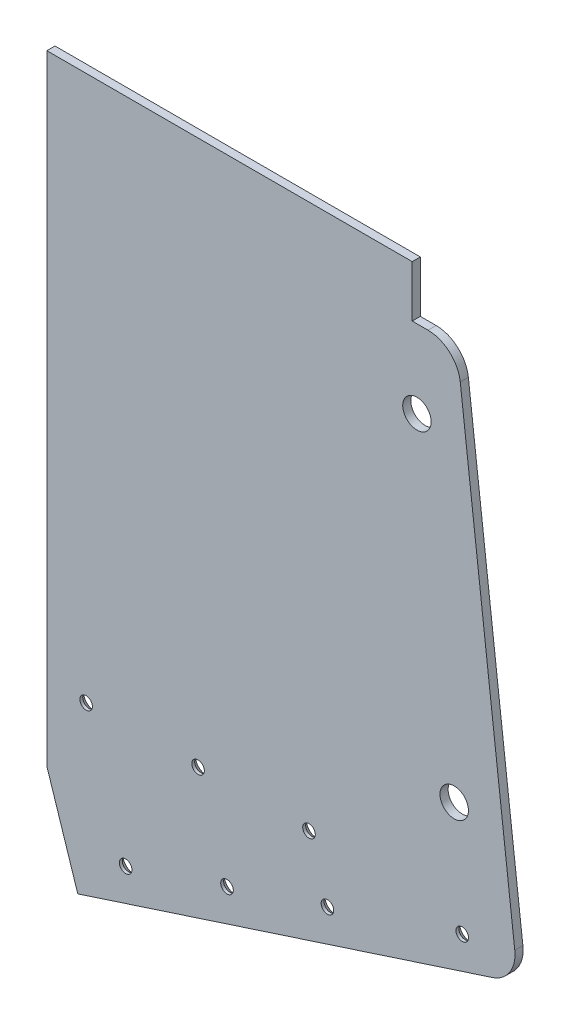
ISO-10303-21;
HEADER;
FILE_DESCRIPTION(('STEP AP214'),'2;1');
FILE_NAME('part.step','',(''),(''),'','','');
FILE_SCHEMA(('AUTOMOTIVE_DESIGN { 1 0 10303 214 1 1 1 1 }'));
ENDSEC;
DATA;
#1=APPLICATION_CONTEXT('core data for automotive mechanical design processes');
#2=APPLICATION_PROTOCOL_DEFINITION('international standard','automotive_design',2000,#1);
#3=PRODUCT_CONTEXT('',#1,'mechanical');
#4=PRODUCT('Part','Part','',(#3));
#5=PRODUCT_RELATED_PRODUCT_CATEGORY('part','',(#4));
#6=PRODUCT_DEFINITION_FORMATION('','',#4);
#7=PRODUCT_DEFINITION_CONTEXT('part definition',#1,'design');
#8=PRODUCT_DEFINITION('design','',#6,#7);
#9=PRODUCT_DEFINITION_SHAPE('','',#8);
#10=(LENGTH_UNIT() NAMED_UNIT(*) SI_UNIT(.MILLI.,.METRE.));
#11=(NAMED_UNIT(*) PLANE_ANGLE_UNIT() SI_UNIT($,.RADIAN.));
#12=(NAMED_UNIT(*) SI_UNIT($,.STERADIAN.) SOLID_ANGLE_UNIT());
#13=UNCERTAINTY_MEASURE_WITH_UNIT(LENGTH_MEASURE(1.E-05),#10,'distance_accuracy_value','');
#14=(GEOMETRIC_REPRESENTATION_CONTEXT(3) GLOBAL_UNCERTAINTY_ASSIGNED_CONTEXT((#13)) GLOBAL_UNIT_ASSIGNED_CONTEXT((#10,
#11,#12)) REPRESENTATION_CONTEXT('',''));
#15=CARTESIAN_POINT('',(0.,0.,0.));
#16=DIRECTION('',(0.,0.,1.));
#17=DIRECTION('',(1.,0.,0.));
#18=AXIS2_PLACEMENT_3D('',#15,#16,#17);
#19=CARTESIAN_POINT('',(-234.75296718065,12.6999999999999,3.17499999999984));
#20=DIRECTION('',(1.,0.,0.));
#21=DIRECTION('',(0.,1.,0.));
#22=AXIS2_PLACEMENT_3D('',#19,#20,#21);
#23=PLANE('',#22);
#24=DIRECTION('',(0.,-1.,0.));
#25=VECTOR('',#24,1.);
#26=CARTESIAN_POINT('',(-234.75296718065,12.6999999999999,-7.49400541621981E-13));
#27=LINE('',#26,#25);
#28=CARTESIAN_POINT('',(-234.75296718065,12.6999999999999,-7.49400541621981E-13));
#29=VERTEX_POINT('',#28);
#30=CARTESIAN_POINT('',(-234.75296718065,-229.485553097581,0.));
#31=VERTEX_POINT('',#30);
#32=EDGE_CURVE('E131',#29,#31,#27,.T.);
#33=ORIENTED_EDGE('',*,*,#32,.T.);
#34=DIRECTION('',(0.,0.,1.));
#35=VECTOR('',#34,1.);
#36=CARTESIAN_POINT('',(-234.75296718065,-229.485553097581,0.));
#37=LINE('',#36,#35);
#38=CARTESIAN_POINT('',(-234.75296718065,-229.485553097581,3.17499999999998));
#39=VERTEX_POINT('',#38);
#40=EDGE_CURVE('E58',#31,#39,#37,.T.);
#41=ORIENTED_EDGE('',*,*,#40,.T.);
#42=DIRECTION('',(0.,-1.,0.));
#43=VECTOR('',#42,1.);
#44=CARTESIAN_POINT('',(-234.75296718065,12.6999999999999,3.17499999999984));
#45=LINE('',#44,#43);
#46=CARTESIAN_POINT('',(-234.75296718065,12.6999999999999,3.17499999999984));
#47=VERTEX_POINT('',#46);
#48=EDGE_CURVE('E144',#47,#39,#45,.T.);
#49=ORIENTED_EDGE('',*,*,#48,.F.);
#50=DIRECTION('',(0.,0.,-1.));
#51=VECTOR('',#50,1.);
#52=CARTESIAN_POINT('',(-234.75296718065,12.6999999999999,3.17499999999984));
#53=LINE('',#52,#51);
#54=EDGE_CURVE('E145',#47,#29,#53,.T.);
#55=ORIENTED_EDGE('',*,*,#54,.T.);
#56=EDGE_LOOP('',(#33,#41,#49,#55));
#57=FACE_BOUND('',#56,.T.);
#58=ADVANCED_FACE('F43',(#57),#23,.F.);
#59=CARTESIAN_POINT('',(-234.752967180649,-270.542758327658,3.17500000000004));
#60=DIRECTION('',(-0.309324512684967,0.950956542567645,0.));
#61=DIRECTION('',(-0.950956542567645,-0.309324512684967,0.));
#62=AXIS2_PLACEMENT_3D('',#59,#60,#61);
#63=PLANE('',#62);
#64=DIRECTION('',(0.950956542567645,0.309324512684967,0.));
#65=VECTOR('',#64,1.);
#66=CARTESIAN_POINT('',(-234.752967180649,-270.542758327658,3.17500000000004));
#67=LINE('',#66,#65);
#68=CARTESIAN_POINT('',(-222.675819090041,-266.614337016557,3.17499999999998));
#69=VERTEX_POINT('',#68);
#70=CARTESIAN_POINT('',(-60.5974720840375,-213.893940804709,3.17500000000032));
#71=VERTEX_POINT('',#70);
#72=EDGE_CURVE('E66',#69,#71,#67,.T.);
#73=ORIENTED_EDGE('',*,*,#72,.F.);
#74=DIRECTION('',(0.,0.,1.));
#75=VECTOR('',#74,1.);
#76=CARTESIAN_POINT('',(-222.675819090041,-266.614337016557,0.));
#77=LINE('',#76,#75);
#78=CARTESIAN_POINT('',(-222.675819090041,-266.614337016557,0.));
#79=VERTEX_POINT('',#78);
#80=EDGE_CURVE('E114',#79,#69,#77,.T.);
#81=ORIENTED_EDGE('',*,*,#80,.F.);
#82=DIRECTION('',(0.950956542567645,0.309324512684967,0.));
#83=VECTOR('',#82,1.);
#84=CARTESIAN_POINT('',(-234.752967180649,-270.542758327658,0.));
#85=LINE('',#84,#83);
#86=CARTESIAN_POINT('',(-60.5974720840375,-213.893940804709,3.33066907387547E-13));
#87=VERTEX_POINT('',#86);
#88=EDGE_CURVE('E123',#79,#87,#85,.T.);
#89=ORIENTED_EDGE('',*,*,#88,.T.);
#90=DIRECTION('',(0.,0.,-1.));
#91=VECTOR('',#90,1.);
#92=CARTESIAN_POINT('',(-60.5974720840375,-213.893940804709,3.17500000000032));
#93=LINE('',#92,#91);
#94=EDGE_CURVE('E11',#87,#71,#93,.F.);
#95=ORIENTED_EDGE('',*,*,#94,.T.);
#96=EDGE_LOOP('',(#73,#81,#89,#95));
#97=FACE_BOUND('',#96,.T.);
#98=ADVANCED_FACE('F122',(#97),#63,.F.);
#99=CARTESIAN_POINT('',(-74.5334651306724,-7.41697903189409,3.17499999999998));
#100=DIRECTION('',(-0.993195579602869,-0.11645832154604,0.));
#101=DIRECTION('',(0.11645832154604,-0.993195579602869,0.));
#102=AXIS2_PLACEMENT_3D('',#99,#100,#101);
#103=PLANE('',#102);
#104=DIRECTION('',(-0.11645832154604,0.993195579602869,0.));
#105=VECTOR('',#104,1.);
#106=CARTESIAN_POINT('',(-74.5334651306729,-7.41697903189298,0.));
#107=LINE('',#106,#105);
#108=CARTESIAN_POINT('',(-51.9123095341807,-200.337772030466,0.));
#109=VERTEX_POINT('',#108);
#110=CARTESIAN_POINT('',(-73.217735938836,-18.6379583482581,7.49400541621981E-13));
#111=VERTEX_POINT('',#110);
#112=EDGE_CURVE('E130',#109,#111,#107,.T.);
#113=ORIENTED_EDGE('',*,*,#112,.T.);
#114=DIRECTION('',(0.,0.,-1.));
#115=VECTOR('',#114,1.);
#116=CARTESIAN_POINT('',(-73.217735938836,-18.637958348259,3.17500000000073));
#117=LINE('',#116,#115);
#118=CARTESIAN_POINT('',(-73.217735938836,-18.637958348259,3.17500000000073));
#119=VERTEX_POINT('',#118);
#120=EDGE_CURVE('E164',#111,#119,#117,.F.);
#121=ORIENTED_EDGE('',*,*,#120,.T.);
#122=DIRECTION('',(-0.11645832154604,0.993195579602869,0.));
#123=VECTOR('',#122,1.);
#124=CARTESIAN_POINT('',(-74.5334651306724,-7.41697903189409,3.17499999999998));
#125=LINE('',#124,#123);
#126=CARTESIAN_POINT('',(-51.9123095341809,-200.337772030466,3.17499999999998));
#127=VERTEX_POINT('',#126);
#128=EDGE_CURVE('E175',#127,#119,#125,.T.);
#129=ORIENTED_EDGE('',*,*,#128,.F.);
#130=DIRECTION('',(0.,0.,-1.));
#131=VECTOR('',#130,1.);
#132=CARTESIAN_POINT('',(-51.9123095341809,-200.337772030466,3.17499999999998));
#133=LINE('',#132,#131);
#134=EDGE_CURVE('E161',#127,#109,#133,.T.);
#135=ORIENTED_EDGE('',*,*,#134,.T.);
#136=EDGE_LOOP('',(#113,#121,#129,#135));
#137=FACE_BOUND('',#136,.T.);
#138=ADVANCED_FACE('F188',(#137),#103,.F.);
#139=CARTESIAN_POINT('',(-74.5334651306724,-7.41697903189409,3.17499999999998));
#140=DIRECTION('',(0.,-1.,0.));
#141=DIRECTION('',(1.,0.,0.));
#142=AXIS2_PLACEMENT_3D('',#139,#140,#141);
#143=PLANE('',#142);
#144=DIRECTION('',(-1.,0.,0.));
#145=VECTOR('',#144,1.);
#146=CARTESIAN_POINT('',(-74.5334651306724,-7.41697903189409,3.17499999999998));
#147=LINE('',#146,#145);
#148=CARTESIAN_POINT('',(-85.831319799792,-7.41697903189453,3.17500000000004));
#149=VERTEX_POINT('',#148);
#150=CARTESIAN_POINT('',(-91.997327392618,-7.41697903189364,3.17500000000004));
#151=VERTEX_POINT('',#150);
#152=EDGE_CURVE('E172',#149,#151,#147,.T.);
#153=ORIENTED_EDGE('',*,*,#152,.F.);
#154=DIRECTION('',(0.,0.,-1.));
#155=VECTOR('',#154,1.);
#156=CARTESIAN_POINT('',(-85.831319799792,-7.41697903189453,3.17500000000004));
#157=LINE('',#156,#155);
#158=CARTESIAN_POINT('',(-85.8313197997921,-7.41697903189387,0.));
#159=VERTEX_POINT('',#158);
#160=EDGE_CURVE('E155',#149,#159,#157,.T.);
#161=ORIENTED_EDGE('',*,*,#160,.T.);
#162=DIRECTION('',(-1.,0.,0.));
#163=VECTOR('',#162,1.);
#164=CARTESIAN_POINT('',(-74.5334651306729,-7.41697903189298,0.));
#165=LINE('',#164,#163);
#166=CARTESIAN_POINT('',(-91.997327392618,-7.41697903189364,0.));
#167=VERTEX_POINT('',#166);
#168=EDGE_CURVE('E134',#159,#167,#165,.T.);
#169=ORIENTED_EDGE('',*,*,#168,.T.);
#170=DIRECTION('',(0.,0.,-1.));
#171=VECTOR('',#170,1.);
#172=CARTESIAN_POINT('',(-91.997327392618,-7.41697903189364,3.17500000000004));
#173=LINE('',#172,#171);
#174=EDGE_CURVE('E152',#151,#167,#173,.T.);
#175=ORIENTED_EDGE('',*,*,#174,.F.);
#176=EDGE_LOOP('',(#153,#161,#169,#175));
#177=FACE_BOUND('',#176,.T.);
#178=ADVANCED_FACE('F180',(#177),#143,.F.);
#179=CARTESIAN_POINT('',(-91.997327392618,-7.41697903189364,3.17500000000004));
#180=DIRECTION('',(-1.,0.,0.));
#181=DIRECTION('',(0.,0.,1.));
#182=AXIS2_PLACEMENT_3D('',#179,#180,#181);
#183=PLANE('',#182);
#184=DIRECTION('',(0.,1.,0.));
#185=VECTOR('',#184,1.);
#186=CARTESIAN_POINT('',(-91.997327392618,-7.41697903189364,0.));
#187=LINE('',#186,#185);
#188=CARTESIAN_POINT('',(-91.9973273926186,12.6999999999995,0.));
#189=VERTEX_POINT('',#188);
#190=EDGE_CURVE('E140',#167,#189,#187,.T.);
#191=ORIENTED_EDGE('',*,*,#190,.T.);
#192=DIRECTION('',(0.,0.,-1.));
#193=VECTOR('',#192,1.);
#194=CARTESIAN_POINT('',(-91.9973273926186,12.6999999999984,3.17499999999998));
#195=LINE('',#194,#193);
#196=CARTESIAN_POINT('',(-91.9973273926186,12.6999999999984,3.17499999999998));
#197=VERTEX_POINT('',#196);
#198=EDGE_CURVE('E148',#197,#189,#195,.T.);
#199=ORIENTED_EDGE('',*,*,#198,.F.);
#200=DIRECTION('',(0.,1.,0.));
#201=VECTOR('',#200,1.);
#202=CARTESIAN_POINT('',(-91.997327392618,-7.41697903189364,3.17500000000004));
#203=LINE('',#202,#201);
#204=EDGE_CURVE('E183',#151,#197,#203,.T.);
#205=ORIENTED_EDGE('',*,*,#204,.F.);
#206=ORIENTED_EDGE('',*,*,#174,.T.);
#207=EDGE_LOOP('',(#191,#199,#205,#206));
#208=FACE_BOUND('',#207,.T.);
#209=ADVANCED_FACE('F211',(#208),#183,.F.);
#210=CARTESIAN_POINT('',(-234.75296718065,12.6999999999999,3.17499999999984));
#211=DIRECTION('',(0.,-1.,0.));
#212=DIRECTION('',(1.,0.,0.));
#213=AXIS2_PLACEMENT_3D('',#210,#211,#212);
#214=PLANE('',#213);
#215=DIRECTION('',(-1.,0.,0.));
#216=VECTOR('',#215,1.);
#217=CARTESIAN_POINT('',(-234.75296718065,12.6999999999999,-7.49400541621981E-13));
#218=LINE('',#217,#216);
#219=EDGE_CURVE('E142',#189,#29,#218,.T.);
#220=ORIENTED_EDGE('',*,*,#219,.T.);
#221=ORIENTED_EDGE('',*,*,#54,.F.);
#222=DIRECTION('',(-1.,0.,0.));
#223=VECTOR('',#222,1.);
#224=CARTESIAN_POINT('',(-234.75296718065,12.6999999999999,3.17499999999984));
#225=LINE('',#224,#223);
#226=EDGE_CURVE('E149',#197,#47,#225,.T.);
#227=ORIENTED_EDGE('',*,*,#226,.F.);
#228=ORIENTED_EDGE('',*,*,#198,.T.);
#229=EDGE_LOOP('',(#220,#221,#227,#228));
#230=FACE_BOUND('',#229,.T.);
#231=ADVANCED_FACE('F214',(#230),#214,.F.);
#232=CARTESIAN_POINT('',(0.,0.,3.17499999999998));
#233=DIRECTION('',(0.,0.,-1.));
#234=DIRECTION('',(-1.,0.,0.));
#235=AXIS2_PLACEMENT_3D('',#232,#233,#234);
#236=PLANE('',#235);
#237=CARTESIAN_POINT('',(-90.146601991197,-37.8407515828578,3.17500000000073));
#238=DIRECTION('',(0.,0.,1.));
#239=DIRECTION('',(1.,0.,0.));
#240=AXIS2_PLACEMENT_3D('',#237,#238,#239);
#241=CIRCLE('',#240,5.55625);
#242=CARTESIAN_POINT('',(-84.590351991197,-37.8407515828578,3.17500000000073));
#243=VERTEX_POINT('',#242);
#244=EDGE_CURVE('E295',#243,#243,#241,.T.);
#245=ORIENTED_EDGE('',*,*,#244,.F.);
#246=EDGE_LOOP('',(#245));
#247=FACE_BOUND('',#246,.T.);
#248=CARTESIAN_POINT('',(-75.5766743950044,-162.097975038986,3.17500000000062));
#249=DIRECTION('',(0.,0.,1.));
#250=DIRECTION('',(1.,0.,0.));
#251=AXIS2_PLACEMENT_3D('',#248,#249,#250);
#252=CIRCLE('',#251,5.55625);
#253=CARTESIAN_POINT('',(-70.0204243950044,-162.097975038986,3.17500000000062));
#254=VERTEX_POINT('',#253);
#255=EDGE_CURVE('E301',#254,#254,#252,.T.);
#256=ORIENTED_EDGE('',*,*,#255,.F.);
#257=EDGE_LOOP('',(#256));
#258=FACE_BOUND('',#257,.T.);
#259=CARTESIAN_POINT('',(-203.969823430369,-247.917009556366,3.17499999999923));
#260=DIRECTION('',(0.,0.,-1.));
#261=DIRECTION('',(-1.,0.,0.));
#262=AXIS2_PLACEMENT_3D('',#259,#260,#261);
#263=CIRCLE('',#262,2.45744999999994);
#264=CARTESIAN_POINT('',(-206.427273430369,-247.917009556366,3.17499999999923));
#265=VERTEX_POINT('',#264);
#266=EDGE_CURVE('E311',#265,#265,#263,.T.);
#267=ORIENTED_EDGE('',*,*,#266,.T.);
#268=EDGE_LOOP('',(#267));
#269=FACE_BOUND('',#268,.T.);
#270=CARTESIAN_POINT('',(-164.368820636905,-235.035704951384,3.1750000000004));
#271=DIRECTION('',(0.,0.,-1.));
#272=DIRECTION('',(-1.,0.,0.));
#273=AXIS2_PLACEMENT_3D('',#270,#271,#272);
#274=CIRCLE('',#273,2.45744999999994);
#275=CARTESIAN_POINT('',(-166.826270636905,-235.035704951384,3.1750000000004));
#276=VERTEX_POINT('',#275);
#277=EDGE_CURVE('E320',#276,#276,#274,.T.);
#278=ORIENTED_EDGE('',*,*,#277,.T.);
#279=EDGE_LOOP('',(#278));
#280=FACE_BOUND('',#279,.T.);
#281=CARTESIAN_POINT('',(-175.687012216855,-200.240181507182,3.17499999999935));
#282=DIRECTION('',(0.,0.,-1.));
#283=DIRECTION('',(-1.,0.,0.));
#284=AXIS2_PLACEMENT_3D('',#281,#282,#283);
#285=CIRCLE('',#284,2.45744999999994);
#286=CARTESIAN_POINT('',(-178.144462216855,-200.240181507182,3.17499999999935));
#287=VERTEX_POINT('',#286);
#288=EDGE_CURVE('E329',#287,#287,#285,.T.);
#289=ORIENTED_EDGE('',*,*,#288,.T.);
#290=EDGE_LOOP('',(#289));
#291=FACE_BOUND('',#290,.T.);
#292=CARTESIAN_POINT('',(-219.438787807227,-200.360762709867,3.17499999999998));
#293=DIRECTION('',(0.,0.,-1.));
#294=DIRECTION('',(-1.,0.,0.));
#295=AXIS2_PLACEMENT_3D('',#292,#293,#294);
#296=CIRCLE('',#295,2.45744999999994);
#297=CARTESIAN_POINT('',(-221.896237807227,-200.360762709867,3.17499999999998));
#298=VERTEX_POINT('',#297);
#299=EDGE_CURVE('E338',#298,#298,#296,.T.);
#300=ORIENTED_EDGE('',*,*,#299,.T.);
#301=EDGE_LOOP('',(#300));
#302=FACE_BOUND('',#301,.T.);
#303=CARTESIAN_POINT('',(-125.11808934242,-222.2683356903,3.17499999999998));
#304=DIRECTION('',(0.,0.,-1.));
#305=DIRECTION('',(-1.,0.,0.));
#306=AXIS2_PLACEMENT_3D('',#303,#304,#305);
#307=CIRCLE('',#306,2.45744999999994);
#308=CARTESIAN_POINT('',(-127.57553934242,-222.2683356903,3.17499999999998));
#309=VERTEX_POINT('',#308);
#310=EDGE_CURVE('E347',#309,#309,#307,.T.);
#311=ORIENTED_EDGE('',*,*,#310,.T.);
#312=EDGE_LOOP('',(#311));
#313=FACE_BOUND('',#312,.T.);
#314=CARTESIAN_POINT('',(-132.322221776819,-200.12066684715,3.17500000000062));
#315=DIRECTION('',(0.,0.,-1.));
#316=DIRECTION('',(-1.,0.,0.));
#317=AXIS2_PLACEMENT_3D('',#314,#315,#316);
#318=CIRCLE('',#317,2.45744999999994);
#319=CARTESIAN_POINT('',(-134.779671776819,-200.12066684715,3.17500000000062));
#320=VERTEX_POINT('',#319);
#321=EDGE_CURVE('E356',#320,#320,#318,.T.);
#322=ORIENTED_EDGE('',*,*,#321,.T.);
#323=EDGE_LOOP('',(#322));
#324=FACE_BOUND('',#323,.T.);
#325=CARTESIAN_POINT('',(-72.4520660392001,-205.137277367342,3.17499999999998));
#326=DIRECTION('',(0.,0.,-1.));
#327=DIRECTION('',(-1.,0.,0.));
#328=AXIS2_PLACEMENT_3D('',#325,#326,#327);
#329=CIRCLE('',#328,2.45744999999994);
#330=CARTESIAN_POINT('',(-74.9095160392001,-205.137277367342,3.17499999999998));
#331=VERTEX_POINT('',#330);
#332=EDGE_CURVE('E365',#331,#331,#329,.T.);
#333=ORIENTED_EDGE('',*,*,#332,.T.);
#334=EDGE_LOOP('',(#333));
#335=FACE_BOUND('',#334,.T.);
#336=ORIENTED_EDGE('',*,*,#48,.T.);
#337=DIRECTION('',(-0.309324512684967,0.950956542567644,0.));
#338=VECTOR('',#337,1.);
#339=CARTESIAN_POINT('',(-222.675819090041,-266.614337016557,3.17499999999998));
#340=LINE('',#339,#338);
#341=EDGE_CURVE('E119',#69,#39,#340,.T.);
#342=ORIENTED_EDGE('',*,*,#341,.F.);
#343=ORIENTED_EDGE('',*,*,#72,.T.);
#344=CARTESIAN_POINT('',(-64.5258933951371,-201.816792714099,3.17500000000032));
#345=DIRECTION('',(0.,0.,-1.));
#346=DIRECTION('',(-1.,0.,0.));
#347=AXIS2_PLACEMENT_3D('',#344,#345,#346);
#348=CIRCLE('',#347,12.7);
#349=EDGE_CURVE('E166',#71,#127,#348,.F.);
#350=ORIENTED_EDGE('',*,*,#349,.T.);
#351=ORIENTED_EDGE('',*,*,#128,.T.);
#352=CARTESIAN_POINT('',(-85.8313197997925,-20.1169790318931,3.17500000000004));
#353=DIRECTION('',(0.,0.,-1.));
#354=DIRECTION('',(-1.,0.,0.));
#355=AXIS2_PLACEMENT_3D('',#352,#353,#354);
#356=CIRCLE('',#355,12.7);
#357=EDGE_CURVE('E51',#119,#149,#356,.F.);
#358=ORIENTED_EDGE('',*,*,#357,.T.);
#359=ORIENTED_EDGE('',*,*,#152,.T.);
#360=ORIENTED_EDGE('',*,*,#204,.T.);
#361=ORIENTED_EDGE('',*,*,#226,.T.);
#362=EDGE_LOOP('',(#336,#342,#343,#350,#351,#358,#359,#360,#361));
#363=FACE_BOUND('',#362,.T.);
#364=ADVANCED_FACE('F171',(#247,#258,#269,#280,#291,#302,#313,#324,#335,#363),#236,.F.);
#365=CARTESIAN_POINT('',(0.,0.,0.));
#366=DIRECTION('',(0.,0.,-1.));
#367=DIRECTION('',(-1.,0.,0.));
#368=AXIS2_PLACEMENT_3D('',#365,#366,#367);
#369=PLANE('',#368);
#370=CARTESIAN_POINT('',(-90.1466019911962,-37.840751582858,7.49400541621981E-13));
#371=DIRECTION('',(0.,0.,-1.));
#372=DIRECTION('',(-1.,0.,0.));
#373=AXIS2_PLACEMENT_3D('',#370,#371,#372);
#374=CIRCLE('',#373,5.55625);
#375=CARTESIAN_POINT('',(-95.7028519911962,-37.840751582858,7.49400541621981E-13));
#376=VERTEX_POINT('',#375);
#377=EDGE_CURVE('E292',#376,#376,#374,.F.);
#378=ORIENTED_EDGE('',*,*,#377,.T.);
#379=EDGE_LOOP('',(#378));
#380=FACE_BOUND('',#379,.T.);
#381=CARTESIAN_POINT('',(-75.5766743950044,-162.097975038986,6.38378239159465E-13));
#382=DIRECTION('',(0.,0.,-1.));
#383=DIRECTION('',(-1.,0.,0.));
#384=AXIS2_PLACEMENT_3D('',#381,#382,#383);
#385=CIRCLE('',#384,5.55625);
#386=CARTESIAN_POINT('',(-81.1329243950044,-162.097975038986,6.38378239159465E-13));
#387=VERTEX_POINT('',#386);
#388=EDGE_CURVE('E306',#387,#387,#385,.F.);
#389=ORIENTED_EDGE('',*,*,#388,.T.);
#390=EDGE_LOOP('',(#389));
#391=FACE_BOUND('',#390,.T.);
#392=CARTESIAN_POINT('',(-203.969823430369,-247.917009556366,-7.49400541621981E-13));
#393=DIRECTION('',(0.,0.,-1.));
#394=DIRECTION('',(-1.,0.,0.));
#395=AXIS2_PLACEMENT_3D('',#392,#393,#394);
#396=CIRCLE('',#395,4.21640000000001);
#397=CARTESIAN_POINT('',(-208.186223430369,-247.917009556366,-7.49400541621981E-13));
#398=VERTEX_POINT('',#397);
#399=EDGE_CURVE('E296',#398,#398,#396,.T.);
#400=ORIENTED_EDGE('',*,*,#399,.F.);
#401=EDGE_LOOP('',(#400));
#402=FACE_BOUND('',#401,.T.);
#403=CARTESIAN_POINT('',(-164.368820636905,-235.035704951384,4.16333634234434E-13));
#404=DIRECTION('',(0.,0.,-1.));
#405=DIRECTION('',(-1.,0.,0.));
#406=AXIS2_PLACEMENT_3D('',#403,#404,#405);
#407=CIRCLE('',#406,4.21640000000001);
#408=CARTESIAN_POINT('',(-168.585220636905,-235.035704951384,4.16333634234434E-13));
#409=VERTEX_POINT('',#408);
#410=EDGE_CURVE('E314',#409,#409,#407,.T.);
#411=ORIENTED_EDGE('',*,*,#410,.F.);
#412=EDGE_LOOP('',(#411));
#413=FACE_BOUND('',#412,.T.);
#414=CARTESIAN_POINT('',(-175.687012216855,-200.240181507182,-6.38378239159465E-13));
#415=DIRECTION('',(0.,0.,-1.));
#416=DIRECTION('',(-1.,0.,0.));
#417=AXIS2_PLACEMENT_3D('',#414,#415,#416);
#418=CIRCLE('',#417,4.21640000000001);
#419=CARTESIAN_POINT('',(-179.903412216855,-200.240181507182,-6.38378239159465E-13));
#420=VERTEX_POINT('',#419);
#421=EDGE_CURVE('E323',#420,#420,#418,.T.);
#422=ORIENTED_EDGE('',*,*,#421,.F.);
#423=EDGE_LOOP('',(#422));
#424=FACE_BOUND('',#423,.T.);
#425=CARTESIAN_POINT('',(-219.438787807228,-200.360762709867,0.));
#426=DIRECTION('',(0.,0.,-1.));
#427=DIRECTION('',(-1.,0.,0.));
#428=AXIS2_PLACEMENT_3D('',#425,#426,#427);
#429=CIRCLE('',#428,4.21640000000001);
#430=CARTESIAN_POINT('',(-223.655187807228,-200.360762709867,0.));
#431=VERTEX_POINT('',#430);
#432=EDGE_CURVE('E332',#431,#431,#429,.T.);
#433=ORIENTED_EDGE('',*,*,#432,.F.);
#434=EDGE_LOOP('',(#433));
#435=FACE_BOUND('',#434,.T.);
#436=CARTESIAN_POINT('',(-125.11808934242,-222.2683356903,0.));
#437=DIRECTION('',(0.,0.,-1.));
#438=DIRECTION('',(-1.,0.,0.));
#439=AXIS2_PLACEMENT_3D('',#436,#437,#438);
#440=CIRCLE('',#439,4.21639999999999);
#441=CARTESIAN_POINT('',(-129.33448934242,-222.2683356903,0.));
#442=VERTEX_POINT('',#441);
#443=EDGE_CURVE('E341',#442,#442,#440,.T.);
#444=ORIENTED_EDGE('',*,*,#443,.F.);
#445=EDGE_LOOP('',(#444));
#446=FACE_BOUND('',#445,.T.);
#447=CARTESIAN_POINT('',(-132.322221776819,-200.12066684715,5.82867087928207E-13));
#448=DIRECTION('',(0.,0.,-1.));
#449=DIRECTION('',(-1.,0.,0.));
#450=AXIS2_PLACEMENT_3D('',#447,#448,#449);
#451=CIRCLE('',#450,4.21640000000001);
#452=CARTESIAN_POINT('',(-136.538621776819,-200.12066684715,5.82867087928207E-13));
#453=VERTEX_POINT('',#452);
#454=EDGE_CURVE('E350',#453,#453,#451,.T.);
#455=ORIENTED_EDGE('',*,*,#454,.F.);
#456=EDGE_LOOP('',(#455));
#457=FACE_BOUND('',#456,.T.);
#458=CARTESIAN_POINT('',(-72.4520660392001,-205.137277367342,0.));
#459=DIRECTION('',(0.,0.,-1.));
#460=DIRECTION('',(-1.,0.,0.));
#461=AXIS2_PLACEMENT_3D('',#458,#459,#460);
#462=CIRCLE('',#461,4.21639999999999);
#463=CARTESIAN_POINT('',(-76.6684660392001,-205.137277367342,0.));
#464=VERTEX_POINT('',#463);
#465=EDGE_CURVE('E359',#464,#464,#462,.T.);
#466=ORIENTED_EDGE('',*,*,#465,.F.);
#467=EDGE_LOOP('',(#466));
#468=FACE_BOUND('',#467,.T.);
#469=DIRECTION('',(-0.309324512684967,0.950956542567644,0.));
#470=VECTOR('',#469,1.);
#471=CARTESIAN_POINT('',(-222.675819090041,-266.614337016557,0.));
#472=LINE('',#471,#470);
#473=EDGE_CURVE('E111',#79,#31,#472,.T.);
#474=ORIENTED_EDGE('',*,*,#473,.T.);
#475=ORIENTED_EDGE('',*,*,#32,.F.);
#476=ORIENTED_EDGE('',*,*,#219,.F.);
#477=ORIENTED_EDGE('',*,*,#190,.F.);
#478=ORIENTED_EDGE('',*,*,#168,.F.);
#479=CARTESIAN_POINT('',(-85.8313197997921,-20.1169790318942,0.));
#480=DIRECTION('',(0.,0.,-1.));
#481=DIRECTION('',(-1.,0.,0.));
#482=AXIS2_PLACEMENT_3D('',#479,#480,#481);
#483=CIRCLE('',#482,12.7);
#484=EDGE_CURVE('E159',#159,#111,#483,.T.);
#485=ORIENTED_EDGE('',*,*,#484,.T.);
#486=ORIENTED_EDGE('',*,*,#112,.F.);
#487=CARTESIAN_POINT('',(-64.5258933951371,-201.816792714099,3.33066907387547E-13));
#488=DIRECTION('',(0.,0.,-1.));
#489=DIRECTION('',(-1.,0.,0.));
#490=AXIS2_PLACEMENT_3D('',#487,#488,#489);
#491=CIRCLE('',#490,12.7);
#492=EDGE_CURVE('E128',#109,#87,#491,.T.);
#493=ORIENTED_EDGE('',*,*,#492,.T.);
#494=ORIENTED_EDGE('',*,*,#88,.F.);
#495=EDGE_LOOP('',(#474,#475,#476,#477,#478,#485,#486,#493,#494));
#496=FACE_BOUND('',#495,.T.);
#497=ADVANCED_FACE('F126',(#380,#391,#402,#413,#424,#435,#446,#457,#468,#496),#369,.T.);
#498=CARTESIAN_POINT('',(-85.8313197997925,-20.1169790318931,3.17500000000004));
#499=DIRECTION('',(0.,0.,-1.));
#500=DIRECTION('',(-1.,0.,0.));
#501=AXIS2_PLACEMENT_3D('',#498,#499,#500);
#502=CYLINDRICAL_SURFACE('',#501,12.7);
#503=ORIENTED_EDGE('',*,*,#357,.F.);
#504=ORIENTED_EDGE('',*,*,#120,.F.);
#505=ORIENTED_EDGE('',*,*,#484,.F.);
#506=ORIENTED_EDGE('',*,*,#160,.F.);
#507=EDGE_LOOP('',(#503,#504,#505,#506));
#508=FACE_BOUND('',#507,.T.);
#509=ADVANCED_FACE('F185',(#508),#502,.T.);
#510=CARTESIAN_POINT('',(-64.5258933951371,-201.816792714099,3.17500000000032));
#511=DIRECTION('',(0.,0.,-1.));
#512=DIRECTION('',(-1.,0.,0.));
#513=AXIS2_PLACEMENT_3D('',#510,#511,#512);
#514=CYLINDRICAL_SURFACE('',#513,12.7);
#515=ORIENTED_EDGE('',*,*,#349,.F.);
#516=ORIENTED_EDGE('',*,*,#94,.F.);
#517=ORIENTED_EDGE('',*,*,#492,.F.);
#518=ORIENTED_EDGE('',*,*,#134,.F.);
#519=EDGE_LOOP('',(#515,#516,#517,#518));
#520=FACE_BOUND('',#519,.T.);
#521=ADVANCED_FACE('F45',(#520),#514,.T.);
#522=CARTESIAN_POINT('',(-222.675819090041,-266.614337016557,0.));
#523=DIRECTION('',(0.950956542567645,0.309324512684967,0.));
#524=DIRECTION('',(-0.309324512684967,0.950956542567645,0.));
#525=AXIS2_PLACEMENT_3D('',#522,#523,#524);
#526=PLANE('',#525);
#527=ORIENTED_EDGE('',*,*,#341,.T.);
#528=ORIENTED_EDGE('',*,*,#40,.F.);
#529=ORIENTED_EDGE('',*,*,#473,.F.);
#530=ORIENTED_EDGE('',*,*,#80,.T.);
#531=EDGE_LOOP('',(#527,#528,#529,#530));
#532=FACE_BOUND('',#531,.T.);
#533=ADVANCED_FACE('F113',(#532),#526,.F.);
#534=CARTESIAN_POINT('',(-72.4520660392001,-205.137277367342,0.));
#535=DIRECTION('',(0.,0.,-1.));
#536=DIRECTION('',(-1.,0.,0.));
#537=AXIS2_PLACEMENT_3D('',#534,#535,#536);
#538=CYLINDRICAL_SURFACE('',#537,2.45744999999994);
#539=ORIENTED_EDGE('',*,*,#332,.F.);
#540=EDGE_LOOP('',(#539));
#541=FACE_BOUND('',#540,.T.);
#542=CARTESIAN_POINT('',(-72.4520660392001,-205.137277367342,2.02344050988146));
#543=DIRECTION('',(0.,0.,-1.));
#544=DIRECTION('',(-1.,0.,0.));
#545=AXIS2_PLACEMENT_3D('',#542,#543,#544);
#546=CIRCLE('',#545,2.45744999999994);
#547=CARTESIAN_POINT('',(-74.9095160392001,-205.137277367342,2.02344050988146));
#548=VERTEX_POINT('',#547);
#549=EDGE_CURVE('E362',#548,#548,#546,.T.);
#550=ORIENTED_EDGE('',*,*,#549,.T.);
#551=EDGE_LOOP('',(#550));
#552=FACE_BOUND('',#551,.T.);
#553=ADVANCED_FACE('F197',(#541,#552),#538,.F.);
#554=CARTESIAN_POINT('',(-72.4520660392001,-205.137277367342,0.));
#555=DIRECTION('',(0.,0.,-1.));
#556=DIRECTION('',(-1.,0.,0.));
#557=AXIS2_PLACEMENT_3D('',#554,#555,#556);
#558=CONICAL_SURFACE('',#557,4.21639999999999,0.715584993317674);
#559=ORIENTED_EDGE('',*,*,#549,.F.);
#560=EDGE_LOOP('',(#559));
#561=FACE_BOUND('',#560,.T.);
#562=ORIENTED_EDGE('',*,*,#465,.T.);
#563=EDGE_LOOP('',(#562));
#564=FACE_BOUND('',#563,.T.);
#565=ADVANCED_FACE('F227',(#561,#564),#558,.F.);
#566=CARTESIAN_POINT('',(-132.322221776819,-200.12066684715,6.38378239159465E-13));
#567=DIRECTION('',(0.,0.,-1.));
#568=DIRECTION('',(-1.,0.,0.));
#569=AXIS2_PLACEMENT_3D('',#566,#567,#568);
#570=CYLINDRICAL_SURFACE('',#569,2.45744999999994);
#571=ORIENTED_EDGE('',*,*,#321,.F.);
#572=EDGE_LOOP('',(#571));
#573=FACE_BOUND('',#572,.T.);
#574=CARTESIAN_POINT('',(-132.322221776819,-200.12066684715,2.0234405098821));
#575=DIRECTION('',(0.,0.,-1.));
#576=DIRECTION('',(-1.,0.,0.));
#577=AXIS2_PLACEMENT_3D('',#574,#575,#576);
#578=CIRCLE('',#577,2.45744999999994);
#579=CARTESIAN_POINT('',(-134.779671776819,-200.12066684715,2.0234405098821));
#580=VERTEX_POINT('',#579);
#581=EDGE_CURVE('E353',#580,#580,#578,.T.);
#582=ORIENTED_EDGE('',*,*,#581,.T.);
#583=EDGE_LOOP('',(#582));
#584=FACE_BOUND('',#583,.T.);
#585=ADVANCED_FACE('F231',(#573,#584),#570,.F.);
#586=CARTESIAN_POINT('',(-132.322221776819,-200.12066684715,5.82867087928207E-13));
#587=DIRECTION('',(0.,0.,-1.));
#588=DIRECTION('',(-1.,0.,0.));
#589=AXIS2_PLACEMENT_3D('',#586,#587,#588);
#590=CONICAL_SURFACE('',#589,4.21640000000001,0.715584993317677);
#591=ORIENTED_EDGE('',*,*,#581,.F.);
#592=EDGE_LOOP('',(#591));
#593=FACE_BOUND('',#592,.T.);
#594=ORIENTED_EDGE('',*,*,#454,.T.);
#595=EDGE_LOOP('',(#594));
#596=FACE_BOUND('',#595,.T.);
#597=ADVANCED_FACE('F235',(#593,#596),#590,.F.);
#598=CARTESIAN_POINT('',(-125.11808934242,-222.2683356903,0.));
#599=DIRECTION('',(0.,0.,-1.));
#600=DIRECTION('',(-1.,0.,0.));
#601=AXIS2_PLACEMENT_3D('',#598,#599,#600);
#602=CYLINDRICAL_SURFACE('',#601,2.45744999999994);
#603=ORIENTED_EDGE('',*,*,#310,.F.);
#604=EDGE_LOOP('',(#603));
#605=FACE_BOUND('',#604,.T.);
#606=CARTESIAN_POINT('',(-125.11808934242,-222.2683356903,2.02344050988146));
#607=DIRECTION('',(0.,0.,-1.));
#608=DIRECTION('',(-1.,0.,0.));
#609=AXIS2_PLACEMENT_3D('',#606,#607,#608);
#610=CIRCLE('',#609,2.45744999999994);
#611=CARTESIAN_POINT('',(-127.57553934242,-222.2683356903,2.02344050988146));
#612=VERTEX_POINT('',#611);
#613=EDGE_CURVE('E344',#612,#612,#610,.T.);
#614=ORIENTED_EDGE('',*,*,#613,.T.);
#615=EDGE_LOOP('',(#614));
#616=FACE_BOUND('',#615,.T.);
#617=ADVANCED_FACE('F239',(#605,#616),#602,.F.);
#618=CARTESIAN_POINT('',(-125.11808934242,-222.2683356903,0.));
#619=DIRECTION('',(0.,0.,-1.));
#620=DIRECTION('',(-1.,0.,0.));
#621=AXIS2_PLACEMENT_3D('',#618,#619,#620);
#622=CONICAL_SURFACE('',#621,4.21639999999999,0.715584993317674);
#623=ORIENTED_EDGE('',*,*,#613,.F.);
#624=EDGE_LOOP('',(#623));
#625=FACE_BOUND('',#624,.T.);
#626=ORIENTED_EDGE('',*,*,#443,.T.);
#627=EDGE_LOOP('',(#626));
#628=FACE_BOUND('',#627,.T.);
#629=ADVANCED_FACE('F243',(#625,#628),#622,.F.);
#630=CARTESIAN_POINT('',(-219.438787807228,-200.360762709867,0.));
#631=DIRECTION('',(0.,0.,-1.));
#632=DIRECTION('',(-1.,0.,0.));
#633=AXIS2_PLACEMENT_3D('',#630,#631,#632);
#634=CYLINDRICAL_SURFACE('',#633,2.45744999999994);
#635=ORIENTED_EDGE('',*,*,#299,.F.);
#636=EDGE_LOOP('',(#635));
#637=FACE_BOUND('',#636,.T.);
#638=CARTESIAN_POINT('',(-219.438787807227,-200.360762709867,2.02344050988146));
#639=DIRECTION('',(0.,0.,-1.));
#640=DIRECTION('',(-1.,0.,0.));
#641=AXIS2_PLACEMENT_3D('',#638,#639,#640);
#642=CIRCLE('',#641,2.45744999999994);
#643=CARTESIAN_POINT('',(-221.896237807227,-200.360762709867,2.02344050988146));
#644=VERTEX_POINT('',#643);
#645=EDGE_CURVE('E335',#644,#644,#642,.T.);
#646=ORIENTED_EDGE('',*,*,#645,.T.);
#647=EDGE_LOOP('',(#646));
#648=FACE_BOUND('',#647,.T.);
#649=ADVANCED_FACE('F247',(#637,#648),#634,.F.);
#650=CARTESIAN_POINT('',(-219.438787807228,-200.360762709867,0.));
#651=DIRECTION('',(0.,0.,-1.));
#652=DIRECTION('',(-1.,0.,0.));
#653=AXIS2_PLACEMENT_3D('',#650,#651,#652);
#654=CONICAL_SURFACE('',#653,4.21640000000001,0.715584993317677);
#655=ORIENTED_EDGE('',*,*,#645,.F.);
#656=EDGE_LOOP('',(#655));
#657=FACE_BOUND('',#656,.T.);
#658=ORIENTED_EDGE('',*,*,#432,.T.);
#659=EDGE_LOOP('',(#658));
#660=FACE_BOUND('',#659,.T.);
#661=ADVANCED_FACE('F251',(#657,#660),#654,.F.);
#662=CARTESIAN_POINT('',(-175.687012216855,-200.240181507182,-6.38378239159465E-13));
#663=DIRECTION('',(0.,0.,-1.));
#664=DIRECTION('',(-1.,0.,0.));
#665=AXIS2_PLACEMENT_3D('',#662,#663,#664);
#666=CYLINDRICAL_SURFACE('',#665,2.45744999999994);
#667=ORIENTED_EDGE('',*,*,#288,.F.);
#668=EDGE_LOOP('',(#667));
#669=FACE_BOUND('',#668,.T.);
#670=CARTESIAN_POINT('',(-175.687012216855,-200.240181507182,2.02344050988082));
#671=DIRECTION('',(0.,0.,-1.));
#672=DIRECTION('',(-1.,0.,0.));
#673=AXIS2_PLACEMENT_3D('',#670,#671,#672);
#674=CIRCLE('',#673,2.45744999999994);
#675=CARTESIAN_POINT('',(-178.144462216855,-200.240181507182,2.02344050988082));
#676=VERTEX_POINT('',#675);
#677=EDGE_CURVE('E326',#676,#676,#674,.T.);
#678=ORIENTED_EDGE('',*,*,#677,.T.);
#679=EDGE_LOOP('',(#678));
#680=FACE_BOUND('',#679,.T.);
#681=ADVANCED_FACE('F255',(#669,#680),#666,.F.);
#682=CARTESIAN_POINT('',(-175.687012216855,-200.240181507182,-6.38378239159465E-13));
#683=DIRECTION('',(0.,0.,-1.));
#684=DIRECTION('',(-1.,0.,0.));
#685=AXIS2_PLACEMENT_3D('',#682,#683,#684);
#686=CONICAL_SURFACE('',#685,4.21640000000001,0.715584993317677);
#687=ORIENTED_EDGE('',*,*,#677,.F.);
#688=EDGE_LOOP('',(#687));
#689=FACE_BOUND('',#688,.T.);
#690=ORIENTED_EDGE('',*,*,#421,.T.);
#691=EDGE_LOOP('',(#690));
#692=FACE_BOUND('',#691,.T.);
#693=ADVANCED_FACE('F259',(#689,#692),#686,.F.);
#694=CARTESIAN_POINT('',(-164.368820636905,-235.035704951384,4.16333634234434E-13));
#695=DIRECTION('',(0.,0.,-1.));
#696=DIRECTION('',(-1.,0.,0.));
#697=AXIS2_PLACEMENT_3D('',#694,#695,#696);
#698=CYLINDRICAL_SURFACE('',#697,2.45744999999994);
#699=ORIENTED_EDGE('',*,*,#277,.F.);
#700=EDGE_LOOP('',(#699));
#701=FACE_BOUND('',#700,.T.);
#702=CARTESIAN_POINT('',(-164.368820636905,-235.035704951384,2.02344050988187));
#703=DIRECTION('',(0.,0.,-1.));
#704=DIRECTION('',(-1.,0.,0.));
#705=AXIS2_PLACEMENT_3D('',#702,#703,#704);
#706=CIRCLE('',#705,2.45744999999994);
#707=CARTESIAN_POINT('',(-166.826270636905,-235.035704951384,2.02344050988187));
#708=VERTEX_POINT('',#707);
#709=EDGE_CURVE('E317',#708,#708,#706,.T.);
#710=ORIENTED_EDGE('',*,*,#709,.T.);
#711=EDGE_LOOP('',(#710));
#712=FACE_BOUND('',#711,.T.);
#713=ADVANCED_FACE('F263',(#701,#712),#698,.F.);
#714=CARTESIAN_POINT('',(-164.368820636905,-235.035704951384,4.16333634234434E-13));
#715=DIRECTION('',(0.,0.,-1.));
#716=DIRECTION('',(-1.,0.,0.));
#717=AXIS2_PLACEMENT_3D('',#714,#715,#716);
#718=CONICAL_SURFACE('',#717,4.21640000000001,0.715584993317677);
#719=ORIENTED_EDGE('',*,*,#709,.F.);
#720=EDGE_LOOP('',(#719));
#721=FACE_BOUND('',#720,.T.);
#722=ORIENTED_EDGE('',*,*,#410,.T.);
#723=EDGE_LOOP('',(#722));
#724=FACE_BOUND('',#723,.T.);
#725=ADVANCED_FACE('F267',(#721,#724),#718,.F.);
#726=CARTESIAN_POINT('',(-203.969823430369,-247.917009556366,-7.49400541621981E-13));
#727=DIRECTION('',(0.,0.,-1.));
#728=DIRECTION('',(-1.,0.,0.));
#729=AXIS2_PLACEMENT_3D('',#726,#727,#728);
#730=CYLINDRICAL_SURFACE('',#729,2.45744999999994);
#731=ORIENTED_EDGE('',*,*,#266,.F.);
#732=EDGE_LOOP('',(#731));
#733=FACE_BOUND('',#732,.T.);
#734=CARTESIAN_POINT('',(-203.969823430369,-247.917009556366,2.02344050988071));
#735=DIRECTION('',(0.,0.,-1.));
#736=DIRECTION('',(-1.,0.,0.));
#737=AXIS2_PLACEMENT_3D('',#734,#735,#736);
#738=CIRCLE('',#737,2.45744999999994);
#739=CARTESIAN_POINT('',(-206.427273430369,-247.917009556366,2.02344050988071));
#740=VERTEX_POINT('',#739);
#741=EDGE_CURVE('E299',#740,#740,#738,.T.);
#742=ORIENTED_EDGE('',*,*,#741,.T.);
#743=EDGE_LOOP('',(#742));
#744=FACE_BOUND('',#743,.T.);
#745=ADVANCED_FACE('F271',(#733,#744),#730,.F.);
#746=CARTESIAN_POINT('',(-203.969823430369,-247.917009556366,-7.49400541621981E-13));
#747=DIRECTION('',(0.,0.,-1.));
#748=DIRECTION('',(-1.,0.,0.));
#749=AXIS2_PLACEMENT_3D('',#746,#747,#748);
#750=CONICAL_SURFACE('',#749,4.21640000000001,0.715584993317677);
#751=ORIENTED_EDGE('',*,*,#741,.F.);
#752=EDGE_LOOP('',(#751));
#753=FACE_BOUND('',#752,.T.);
#754=ORIENTED_EDGE('',*,*,#399,.T.);
#755=EDGE_LOOP('',(#754));
#756=FACE_BOUND('',#755,.T.);
#757=ADVANCED_FACE('F275',(#753,#756),#750,.F.);
#758=CARTESIAN_POINT('',(-75.5766743950044,-162.097975038986,-0.000999999999390377));
#759=DIRECTION('',(0.,0.,1.));
#760=DIRECTION('',(1.,0.,0.));
#761=AXIS2_PLACEMENT_3D('',#758,#759,#760);
#762=CYLINDRICAL_SURFACE('',#761,5.55625);
#763=ORIENTED_EDGE('',*,*,#388,.F.);
#764=EDGE_LOOP('',(#763));
#765=FACE_BOUND('',#764,.T.);
#766=ORIENTED_EDGE('',*,*,#255,.T.);
#767=EDGE_LOOP('',(#766));
#768=FACE_BOUND('',#767,.T.);
#769=ADVANCED_FACE('F279',(#765,#768),#762,.F.);
#770=CARTESIAN_POINT('',(-90.1466019911962,-37.840751582858,-0.000999999999223844));
#771=DIRECTION('',(0.,0.,1.));
#772=DIRECTION('',(1.,0.,0.));
#773=AXIS2_PLACEMENT_3D('',#770,#771,#772);
#774=CYLINDRICAL_SURFACE('',#773,5.55625);
#775=ORIENTED_EDGE('',*,*,#377,.F.);
#776=EDGE_LOOP('',(#775));
#777=FACE_BOUND('',#776,.T.);
#778=ORIENTED_EDGE('',*,*,#244,.T.);
#779=EDGE_LOOP('',(#778));
#780=FACE_BOUND('',#779,.T.);
#781=ADVANCED_FACE('F283',(#777,#780),#774,.F.);
#782=CLOSED_SHELL('',(#58,#98,#138,#178,#209,#231,#364,#497,#509,#521,#533,#553,#565,#585,#597,
#617,#629,#649,#661,#681,#693,#713,#725,#745,#757,#769,#781));
#783=MANIFOLD_SOLID_BREP('B2',#782);
#784=ADVANCED_BREP_SHAPE_REPRESENTATION('',(#18,#783),#14);
#785=SHAPE_DEFINITION_REPRESENTATION(#9,#784);
ENDSEC;
END-ISO-10303-21;
